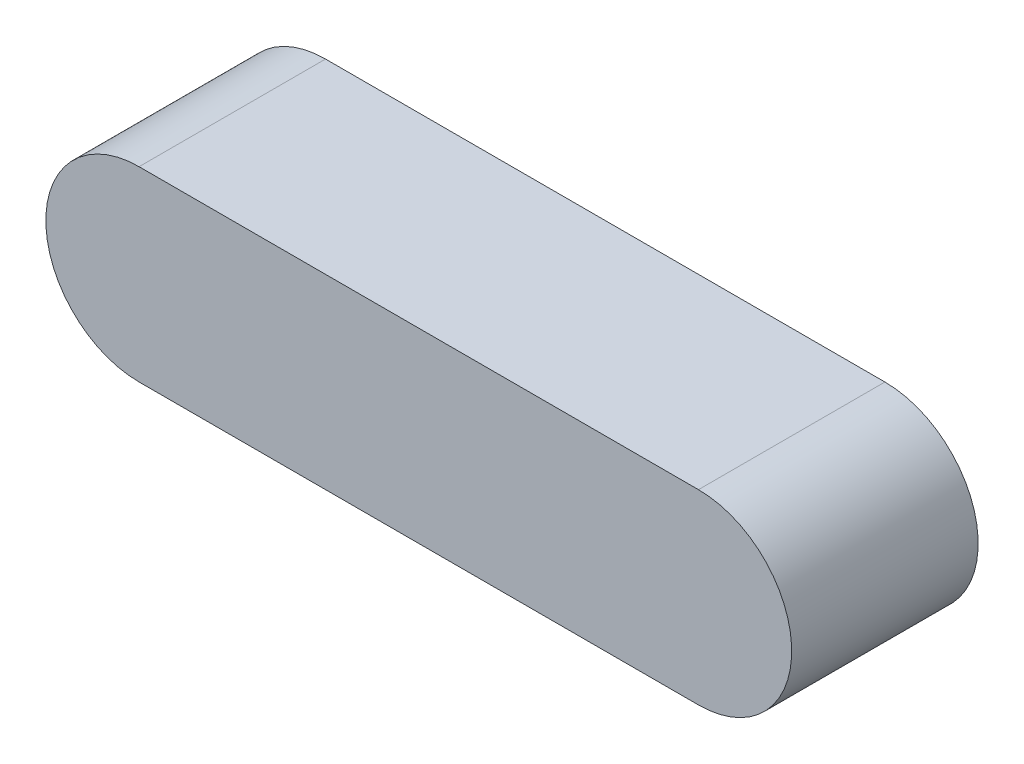
ISO-10303-21;
HEADER;
FILE_DESCRIPTION(('STEP AP214'),'2;1');
FILE_NAME('part.step','',(''),(''),'','','');
FILE_SCHEMA(('AUTOMOTIVE_DESIGN { 1 0 10303 214 1 1 1 1 }'));
ENDSEC;
DATA;
#1=APPLICATION_CONTEXT('core data for automotive mechanical design processes');
#2=APPLICATION_PROTOCOL_DEFINITION('international standard','automotive_design',2000,#1);
#3=PRODUCT_CONTEXT('',#1,'mechanical');
#4=PRODUCT('Part','Part','',(#3));
#5=PRODUCT_RELATED_PRODUCT_CATEGORY('part','',(#4));
#6=PRODUCT_DEFINITION_FORMATION('','',#4);
#7=PRODUCT_DEFINITION_CONTEXT('part definition',#1,'design');
#8=PRODUCT_DEFINITION('design','',#6,#7);
#9=PRODUCT_DEFINITION_SHAPE('','',#8);
#10=(LENGTH_UNIT() NAMED_UNIT(*) SI_UNIT(.MILLI.,.METRE.));
#11=(NAMED_UNIT(*) PLANE_ANGLE_UNIT() SI_UNIT($,.RADIAN.));
#12=(NAMED_UNIT(*) SI_UNIT($,.STERADIAN.) SOLID_ANGLE_UNIT());
#13=UNCERTAINTY_MEASURE_WITH_UNIT(LENGTH_MEASURE(1.E-05),#10,'distance_accuracy_value','');
#14=(GEOMETRIC_REPRESENTATION_CONTEXT(3) GLOBAL_UNCERTAINTY_ASSIGNED_CONTEXT((#13)) GLOBAL_UNIT_ASSIGNED_CONTEXT((#10,
#11,#12)) REPRESENTATION_CONTEXT('',''));
#15=CARTESIAN_POINT('',(0.,0.,0.));
#16=DIRECTION('',(0.,0.,1.));
#17=DIRECTION('',(1.,0.,0.));
#18=AXIS2_PLACEMENT_3D('',#15,#16,#17);
#19=CARTESIAN_POINT('',(-9.525,0.,-3.175));
#20=DIRECTION('',(0.,0.,1.));
#21=DIRECTION('',(1.,0.,0.));
#22=AXIS2_PLACEMENT_3D('',#19,#20,#21);
#23=CYLINDRICAL_SURFACE('',#22,3.175);
#24=DIRECTION('',(0.,0.,1.));
#25=VECTOR('',#24,1.);
#26=CARTESIAN_POINT('',(-9.525,-3.175,-3.175));
#27=LINE('',#26,#25);
#28=CARTESIAN_POINT('',(-9.525,-3.175,-3.175));
#29=VERTEX_POINT('',#28);
#30=CARTESIAN_POINT('',(-9.525,-3.175,3.175));
#31=VERTEX_POINT('',#30);
#32=EDGE_CURVE('E37',#29,#31,#27,.T.);
#33=ORIENTED_EDGE('',*,*,#32,.T.);
#34=CARTESIAN_POINT('',(-9.525,0.,3.175));
#35=DIRECTION('',(0.,0.,1.));
#36=DIRECTION('',(1.,0.,0.));
#37=AXIS2_PLACEMENT_3D('',#34,#35,#36);
#38=CIRCLE('',#37,3.175);
#39=CARTESIAN_POINT('',(-9.525,3.175,3.175));
#40=VERTEX_POINT('',#39);
#41=EDGE_CURVE('E74',#40,#31,#38,.T.);
#42=ORIENTED_EDGE('',*,*,#41,.F.);
#43=DIRECTION('',(0.,0.,1.));
#44=VECTOR('',#43,1.);
#45=CARTESIAN_POINT('',(-9.525,3.175,-3.175));
#46=LINE('',#45,#44);
#47=CARTESIAN_POINT('',(-9.525,3.175,-3.175));
#48=VERTEX_POINT('',#47);
#49=EDGE_CURVE('E11',#48,#40,#46,.T.);
#50=ORIENTED_EDGE('',*,*,#49,.F.);
#51=CARTESIAN_POINT('',(-9.525,0.,-3.175));
#52=DIRECTION('',(0.,0.,1.));
#53=DIRECTION('',(1.,0.,0.));
#54=AXIS2_PLACEMENT_3D('',#51,#52,#53);
#55=CIRCLE('',#54,3.175);
#56=EDGE_CURVE('E75',#48,#29,#55,.T.);
#57=ORIENTED_EDGE('',*,*,#56,.T.);
#58=EDGE_LOOP('',(#33,#42,#50,#57));
#59=FACE_BOUND('',#58,.T.);
#60=ADVANCED_FACE('F34',(#59),#23,.T.);
#61=CARTESIAN_POINT('',(-9.525,3.175,-3.175));
#62=DIRECTION('',(0.,1.,0.));
#63=DIRECTION('',(-1.,0.,0.));
#64=AXIS2_PLACEMENT_3D('',#61,#62,#63);
#65=PLANE('',#64);
#66=ORIENTED_EDGE('',*,*,#49,.T.);
#67=DIRECTION('',(-1.,0.,0.));
#68=VECTOR('',#67,1.);
#69=CARTESIAN_POINT('',(-9.525,3.175,3.175));
#70=LINE('',#69,#68);
#71=CARTESIAN_POINT('',(9.525,3.175,3.175));
#72=VERTEX_POINT('',#71);
#73=EDGE_CURVE('E91',#72,#40,#70,.T.);
#74=ORIENTED_EDGE('',*,*,#73,.F.);
#75=DIRECTION('',(0.,0.,1.));
#76=VECTOR('',#75,1.);
#77=CARTESIAN_POINT('',(9.525,3.175,-3.175));
#78=LINE('',#77,#76);
#79=CARTESIAN_POINT('',(9.525,3.175,-3.175));
#80=VERTEX_POINT('',#79);
#81=EDGE_CURVE('E42',#80,#72,#78,.T.);
#82=ORIENTED_EDGE('',*,*,#81,.F.);
#83=DIRECTION('',(-1.,0.,0.));
#84=VECTOR('',#83,1.);
#85=CARTESIAN_POINT('',(-9.525,3.175,-3.175));
#86=LINE('',#85,#84);
#87=EDGE_CURVE('E80',#80,#48,#86,.T.);
#88=ORIENTED_EDGE('',*,*,#87,.T.);
#89=EDGE_LOOP('',(#66,#74,#82,#88));
#90=FACE_BOUND('',#89,.T.);
#91=ADVANCED_FACE('F106',(#90),#65,.T.);
#92=CARTESIAN_POINT('',(9.525,0.,-3.175));
#93=DIRECTION('',(0.,0.,1.));
#94=DIRECTION('',(1.,0.,0.));
#95=AXIS2_PLACEMENT_3D('',#92,#93,#94);
#96=CYLINDRICAL_SURFACE('',#95,3.175);
#97=ORIENTED_EDGE('',*,*,#81,.T.);
#98=CARTESIAN_POINT('',(9.525,0.,3.175));
#99=DIRECTION('',(0.,0.,1.));
#100=DIRECTION('',(1.,0.,0.));
#101=AXIS2_PLACEMENT_3D('',#98,#99,#100);
#102=CIRCLE('',#101,3.175);
#103=CARTESIAN_POINT('',(9.525,-3.175,3.175));
#104=VERTEX_POINT('',#103);
#105=EDGE_CURVE('E87',#104,#72,#102,.T.);
#106=ORIENTED_EDGE('',*,*,#105,.F.);
#107=DIRECTION('',(0.,0.,1.));
#108=VECTOR('',#107,1.);
#109=CARTESIAN_POINT('',(9.525,-3.175,-3.175));
#110=LINE('',#109,#108);
#111=CARTESIAN_POINT('',(9.525,-3.175,-3.175));
#112=VERTEX_POINT('',#111);
#113=EDGE_CURVE('E79',#112,#104,#110,.T.);
#114=ORIENTED_EDGE('',*,*,#113,.F.);
#115=CARTESIAN_POINT('',(9.525,0.,-3.175));
#116=DIRECTION('',(0.,0.,1.));
#117=DIRECTION('',(1.,0.,0.));
#118=AXIS2_PLACEMENT_3D('',#115,#116,#117);
#119=CIRCLE('',#118,3.175);
#120=EDGE_CURVE('E99',#112,#80,#119,.T.);
#121=ORIENTED_EDGE('',*,*,#120,.T.);
#122=EDGE_LOOP('',(#97,#106,#114,#121));
#123=FACE_BOUND('',#122,.T.);
#124=ADVANCED_FACE('F103',(#123),#96,.T.);
#125=CARTESIAN_POINT('',(-9.525,-3.175,-3.175));
#126=DIRECTION('',(0.,-1.,0.));
#127=DIRECTION('',(1.,0.,0.));
#128=AXIS2_PLACEMENT_3D('',#125,#126,#127);
#129=PLANE('',#128);
#130=ORIENTED_EDGE('',*,*,#113,.T.);
#131=DIRECTION('',(1.,0.,0.));
#132=VECTOR('',#131,1.);
#133=CARTESIAN_POINT('',(-9.525,-3.175,3.175));
#134=LINE('',#133,#132);
#135=EDGE_CURVE('E82',#31,#104,#134,.T.);
#136=ORIENTED_EDGE('',*,*,#135,.F.);
#137=ORIENTED_EDGE('',*,*,#32,.F.);
#138=DIRECTION('',(1.,0.,0.));
#139=VECTOR('',#138,1.);
#140=CARTESIAN_POINT('',(-9.525,-3.175,-3.175));
#141=LINE('',#140,#139);
#142=EDGE_CURVE('E97',#29,#112,#141,.T.);
#143=ORIENTED_EDGE('',*,*,#142,.T.);
#144=EDGE_LOOP('',(#130,#136,#137,#143));
#145=FACE_BOUND('',#144,.T.);
#146=ADVANCED_FACE('F83',(#145),#129,.T.);
#147=CARTESIAN_POINT('',(-9.525,0.,-3.175));
#148=DIRECTION('',(0.,0.,1.));
#149=DIRECTION('',(1.,0.,0.));
#150=AXIS2_PLACEMENT_3D('',#147,#148,#149);
#151=PLANE('',#150);
#152=ORIENTED_EDGE('',*,*,#56,.F.);
#153=ORIENTED_EDGE('',*,*,#87,.F.);
#154=ORIENTED_EDGE('',*,*,#120,.F.);
#155=ORIENTED_EDGE('',*,*,#142,.F.);
#156=EDGE_LOOP('',(#152,#153,#154,#155));
#157=FACE_BOUND('',#156,.T.);
#158=ADVANCED_FACE('F108',(#157),#151,.F.);
#159=CARTESIAN_POINT('',(-9.525,0.,3.175));
#160=DIRECTION('',(0.,0.,1.));
#161=DIRECTION('',(1.,0.,0.));
#162=AXIS2_PLACEMENT_3D('',#159,#160,#161);
#163=PLANE('',#162);
#164=ORIENTED_EDGE('',*,*,#41,.T.);
#165=ORIENTED_EDGE('',*,*,#135,.T.);
#166=ORIENTED_EDGE('',*,*,#105,.T.);
#167=ORIENTED_EDGE('',*,*,#73,.T.);
#168=EDGE_LOOP('',(#164,#165,#166,#167));
#169=FACE_BOUND('',#168,.T.);
#170=ADVANCED_FACE('F90',(#169),#163,.T.);
#171=CLOSED_SHELL('',(#60,#91,#124,#146,#158,#170));
#172=MANIFOLD_SOLID_BREP('B2',#171);
#173=ADVANCED_BREP_SHAPE_REPRESENTATION('',(#18,#172),#14);
#174=SHAPE_DEFINITION_REPRESENTATION(#9,#173);
ENDSEC;
END-ISO-10303-21;
